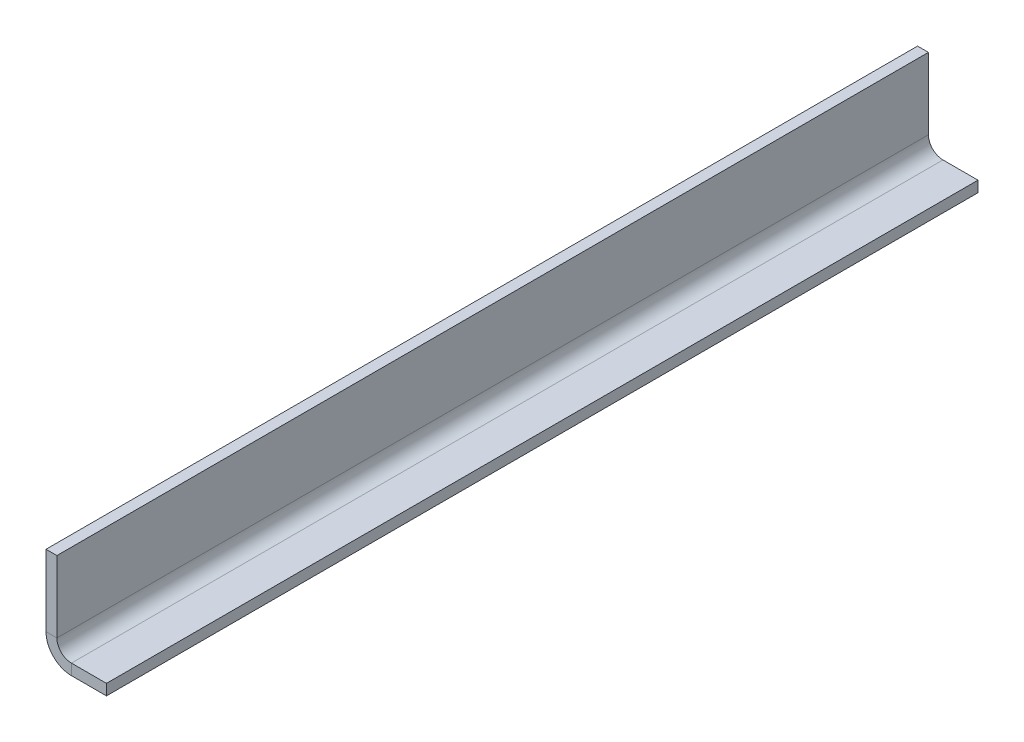
ISO-10303-21;
HEADER;
FILE_DESCRIPTION(('STEP AP214'),'2;1');
FILE_NAME('part.step','',(''),(''),'','','');
FILE_SCHEMA(('AUTOMOTIVE_DESIGN { 1 0 10303 214 1 1 1 1 }'));
ENDSEC;
DATA;
#1=APPLICATION_CONTEXT('core data for automotive mechanical design processes');
#2=APPLICATION_PROTOCOL_DEFINITION('international standard','automotive_design',2000,#1);
#3=PRODUCT_CONTEXT('',#1,'mechanical');
#4=PRODUCT('Part','Part','',(#3));
#5=PRODUCT_RELATED_PRODUCT_CATEGORY('part','',(#4));
#6=PRODUCT_DEFINITION_FORMATION('','',#4);
#7=PRODUCT_DEFINITION_CONTEXT('part definition',#1,'design');
#8=PRODUCT_DEFINITION('design','',#6,#7);
#9=PRODUCT_DEFINITION_SHAPE('','',#8);
#10=(LENGTH_UNIT() NAMED_UNIT(*) SI_UNIT(.MILLI.,.METRE.));
#11=(NAMED_UNIT(*) PLANE_ANGLE_UNIT() SI_UNIT($,.RADIAN.));
#12=(NAMED_UNIT(*) SI_UNIT($,.STERADIAN.) SOLID_ANGLE_UNIT());
#13=UNCERTAINTY_MEASURE_WITH_UNIT(LENGTH_MEASURE(1.E-05),#10,'distance_accuracy_value','');
#14=(GEOMETRIC_REPRESENTATION_CONTEXT(3) GLOBAL_UNCERTAINTY_ASSIGNED_CONTEXT((#13)) GLOBAL_UNIT_ASSIGNED_CONTEXT((#10,
#11,#12)) REPRESENTATION_CONTEXT('',''));
#15=CARTESIAN_POINT('',(0.,0.,0.));
#16=DIRECTION('',(0.,0.,1.));
#17=DIRECTION('',(1.,0.,0.));
#18=AXIS2_PLACEMENT_3D('',#15,#16,#17);
#19=CARTESIAN_POINT('',(3.175,3.175,0.));
#20=DIRECTION('',(0.,0.,1.));
#21=DIRECTION('',(0.,1.,0.));
#22=AXIS2_PLACEMENT_3D('',#19,#20,#21);
#23=PLANE('',#22);
#24=DIRECTION('',(1.,0.,0.));
#25=VECTOR('',#24,1.);
#26=CARTESIAN_POINT('',(3.175,5.175,0.));
#27=LINE('',#26,#25);
#28=CARTESIAN_POINT('',(1.675,5.175,0.));
#29=VERTEX_POINT('',#28);
#30=CARTESIAN_POINT('',(3.175,5.175,0.));
#31=VERTEX_POINT('',#30);
#32=EDGE_CURVE('E11',#29,#31,#27,.T.);
#33=ORIENTED_EDGE('',*,*,#32,.F.);
#34=DIRECTION('',(0.,-1.,0.));
#35=VECTOR('',#34,1.);
#36=CARTESIAN_POINT('',(1.675,3.175,0.));
#37=LINE('',#36,#35);
#38=CARTESIAN_POINT('',(1.675,15.,0.));
#39=VERTEX_POINT('',#38);
#40=EDGE_CURVE('E95',#29,#39,#37,.F.);
#41=ORIENTED_EDGE('',*,*,#40,.T.);
#42=DIRECTION('',(1.,0.,0.));
#43=VECTOR('',#42,1.);
#44=CARTESIAN_POINT('',(3.175,15.,0.));
#45=LINE('',#44,#43);
#46=CARTESIAN_POINT('',(3.175,15.,0.));
#47=VERTEX_POINT('',#46);
#48=EDGE_CURVE('E55',#39,#47,#45,.T.);
#49=ORIENTED_EDGE('',*,*,#48,.T.);
#50=DIRECTION('',(0.,1.,0.));
#51=VECTOR('',#50,1.);
#52=CARTESIAN_POINT('',(3.175,3.175,0.));
#53=LINE('',#52,#51);
#54=EDGE_CURVE('E98',#31,#47,#53,.T.);
#55=ORIENTED_EDGE('',*,*,#54,.F.);
#56=EDGE_LOOP('',(#33,#41,#49,#55));
#57=FACE_BOUND('',#56,.T.);
#58=ADVANCED_FACE('F45',(#57),#23,.F.);
#59=CARTESIAN_POINT('',(3.175,15.,120.));
#60=DIRECTION('',(0.,1.,0.));
#61=DIRECTION('',(0.,0.,-1.));
#62=AXIS2_PLACEMENT_3D('',#59,#60,#61);
#63=PLANE('',#62);
#64=ORIENTED_EDGE('',*,*,#48,.F.);
#65=DIRECTION('',(0.,0.,1.));
#66=VECTOR('',#65,1.);
#67=CARTESIAN_POINT('',(1.675,15.,120.));
#68=LINE('',#67,#66);
#69=CARTESIAN_POINT('',(1.675,15.,120.));
#70=VERTEX_POINT('',#69);
#71=EDGE_CURVE('E123',#70,#39,#68,.F.);
#72=ORIENTED_EDGE('',*,*,#71,.F.);
#73=DIRECTION('',(1.,0.,0.));
#74=VECTOR('',#73,1.);
#75=CARTESIAN_POINT('',(3.175,15.,120.));
#76=LINE('',#75,#74);
#77=CARTESIAN_POINT('',(3.175,15.,120.));
#78=VERTEX_POINT('',#77);
#79=EDGE_CURVE('E141',#70,#78,#76,.T.);
#80=ORIENTED_EDGE('',*,*,#79,.T.);
#81=DIRECTION('',(0.,0.,-1.));
#82=VECTOR('',#81,1.);
#83=CARTESIAN_POINT('',(3.175,15.,120.));
#84=LINE('',#83,#82);
#85=EDGE_CURVE('E152',#78,#47,#84,.T.);
#86=ORIENTED_EDGE('',*,*,#85,.T.);
#87=EDGE_LOOP('',(#64,#72,#80,#86));
#88=FACE_BOUND('',#87,.T.);
#89=ADVANCED_FACE('F158',(#88),#63,.T.);
#90=CARTESIAN_POINT('',(3.175,3.175,120.));
#91=DIRECTION('',(0.,0.,1.));
#92=DIRECTION('',(0.,1.,0.));
#93=AXIS2_PLACEMENT_3D('',#90,#91,#92);
#94=PLANE('',#93);
#95=ORIENTED_EDGE('',*,*,#79,.F.);
#96=DIRECTION('',(0.,-1.,0.));
#97=VECTOR('',#96,1.);
#98=CARTESIAN_POINT('',(1.675,3.175,120.));
#99=LINE('',#98,#97);
#100=CARTESIAN_POINT('',(1.675,5.175,120.));
#101=VERTEX_POINT('',#100);
#102=EDGE_CURVE('E183',#101,#70,#99,.F.);
#103=ORIENTED_EDGE('',*,*,#102,.F.);
#104=DIRECTION('',(1.,0.,0.));
#105=VECTOR('',#104,1.);
#106=CARTESIAN_POINT('',(3.175,5.175,120.));
#107=LINE('',#106,#105);
#108=CARTESIAN_POINT('',(3.175,5.175,120.));
#109=VERTEX_POINT('',#108);
#110=EDGE_CURVE('E138',#101,#109,#107,.T.);
#111=ORIENTED_EDGE('',*,*,#110,.T.);
#112=DIRECTION('',(0.,1.,0.));
#113=VECTOR('',#112,1.);
#114=CARTESIAN_POINT('',(3.175,3.175,120.));
#115=LINE('',#114,#113);
#116=EDGE_CURVE('E159',#109,#78,#115,.T.);
#117=ORIENTED_EDGE('',*,*,#116,.T.);
#118=EDGE_LOOP('',(#95,#103,#111,#117));
#119=FACE_BOUND('',#118,.T.);
#120=ADVANCED_FACE('F189',(#119),#94,.T.);
#121=CARTESIAN_POINT('',(5.175,5.175,120.));
#122=DIRECTION('',(0.,0.,1.));
#123=DIRECTION('',(1.,0.,0.));
#124=AXIS2_PLACEMENT_3D('',#121,#122,#123);
#125=PLANE('',#124);
#126=ORIENTED_EDGE('',*,*,#110,.F.);
#127=CARTESIAN_POINT('',(5.175,5.175,120.));
#128=DIRECTION('',(0.,0.,1.));
#129=DIRECTION('',(1.,0.,0.));
#130=AXIS2_PLACEMENT_3D('',#127,#128,#129);
#131=CIRCLE('',#130,3.5);
#132=CARTESIAN_POINT('',(5.17500000000001,1.675,120.));
#133=VERTEX_POINT('',#132);
#134=EDGE_CURVE('E113',#101,#133,#131,.T.);
#135=ORIENTED_EDGE('',*,*,#134,.T.);
#136=DIRECTION('',(0.,1.,0.));
#137=VECTOR('',#136,1.);
#138=CARTESIAN_POINT('',(5.175,3.175,120.));
#139=LINE('',#138,#137);
#140=CARTESIAN_POINT('',(5.175,3.175,120.));
#141=VERTEX_POINT('',#140);
#142=EDGE_CURVE('E63',#133,#141,#139,.T.);
#143=ORIENTED_EDGE('',*,*,#142,.T.);
#144=CARTESIAN_POINT('',(5.175,5.175,120.));
#145=DIRECTION('',(0.,0.,-1.));
#146=DIRECTION('',(-1.,0.,0.));
#147=AXIS2_PLACEMENT_3D('',#144,#145,#146);
#148=CIRCLE('',#147,2.);
#149=EDGE_CURVE('E156',#109,#141,#148,.F.);
#150=ORIENTED_EDGE('',*,*,#149,.F.);
#151=EDGE_LOOP('',(#126,#135,#143,#150));
#152=FACE_BOUND('',#151,.T.);
#153=ADVANCED_FACE('F192',(#152),#125,.T.);
#154=CARTESIAN_POINT('',(10.,3.175,120.));
#155=DIRECTION('',(0.,0.,1.));
#156=DIRECTION('',(-1.,0.,0.));
#157=AXIS2_PLACEMENT_3D('',#154,#155,#156);
#158=PLANE('',#157);
#159=ORIENTED_EDGE('',*,*,#142,.F.);
#160=DIRECTION('',(1.,0.,0.));
#161=VECTOR('',#160,1.);
#162=CARTESIAN_POINT('',(10.,1.675,120.));
#163=LINE('',#162,#161);
#164=CARTESIAN_POINT('',(10.,1.675,120.));
#165=VERTEX_POINT('',#164);
#166=EDGE_CURVE('E182',#165,#133,#163,.F.);
#167=ORIENTED_EDGE('',*,*,#166,.F.);
#168=DIRECTION('',(0.,1.,0.));
#169=VECTOR('',#168,1.);
#170=CARTESIAN_POINT('',(10.,3.175,120.));
#171=LINE('',#170,#169);
#172=CARTESIAN_POINT('',(10.,3.175,120.));
#173=VERTEX_POINT('',#172);
#174=EDGE_CURVE('E134',#165,#173,#171,.T.);
#175=ORIENTED_EDGE('',*,*,#174,.T.);
#176=DIRECTION('',(-1.,0.,0.));
#177=VECTOR('',#176,1.);
#178=CARTESIAN_POINT('',(10.,3.175,120.));
#179=LINE('',#178,#177);
#180=EDGE_CURVE('E166',#173,#141,#179,.T.);
#181=ORIENTED_EDGE('',*,*,#180,.T.);
#182=EDGE_LOOP('',(#159,#167,#175,#181));
#183=FACE_BOUND('',#182,.T.);
#184=ADVANCED_FACE('F203',(#183),#158,.T.);
#185=CARTESIAN_POINT('',(10.,3.175,120.));
#186=DIRECTION('',(-1.,0.,0.));
#187=DIRECTION('',(0.,0.,-1.));
#188=AXIS2_PLACEMENT_3D('',#185,#186,#187);
#189=PLANE('',#188);
#190=ORIENTED_EDGE('',*,*,#174,.F.);
#191=DIRECTION('',(0.,0.,1.));
#192=VECTOR('',#191,1.);
#193=CARTESIAN_POINT('',(10.,1.675,120.));
#194=LINE('',#193,#192);
#195=CARTESIAN_POINT('',(10.,1.675,0.));
#196=VERTEX_POINT('',#195);
#197=EDGE_CURVE('E118',#165,#196,#194,.F.);
#198=ORIENTED_EDGE('',*,*,#197,.T.);
#199=DIRECTION('',(0.,1.,0.));
#200=VECTOR('',#199,1.);
#201=CARTESIAN_POINT('',(10.,3.175,0.));
#202=LINE('',#201,#200);
#203=CARTESIAN_POINT('',(10.,3.175,0.));
#204=VERTEX_POINT('',#203);
#205=EDGE_CURVE('E131',#196,#204,#202,.T.);
#206=ORIENTED_EDGE('',*,*,#205,.T.);
#207=DIRECTION('',(0.,0.,-1.));
#208=VECTOR('',#207,1.);
#209=CARTESIAN_POINT('',(10.,3.175,120.));
#210=LINE('',#209,#208);
#211=EDGE_CURVE('E169',#173,#204,#210,.T.);
#212=ORIENTED_EDGE('',*,*,#211,.F.);
#213=EDGE_LOOP('',(#190,#198,#206,#212));
#214=FACE_BOUND('',#213,.T.);
#215=ADVANCED_FACE('F209',(#214),#189,.F.);
#216=CARTESIAN_POINT('',(10.,3.175,0.));
#217=DIRECTION('',(0.,0.,1.));
#218=DIRECTION('',(-1.,0.,0.));
#219=AXIS2_PLACEMENT_3D('',#216,#217,#218);
#220=PLANE('',#219);
#221=ORIENTED_EDGE('',*,*,#205,.F.);
#222=DIRECTION('',(1.,0.,0.));
#223=VECTOR('',#222,1.);
#224=CARTESIAN_POINT('',(10.,1.675,0.));
#225=LINE('',#224,#223);
#226=CARTESIAN_POINT('',(5.175,1.675,0.));
#227=VERTEX_POINT('',#226);
#228=EDGE_CURVE('E180',#196,#227,#225,.F.);
#229=ORIENTED_EDGE('',*,*,#228,.T.);
#230=DIRECTION('',(0.,1.,0.));
#231=VECTOR('',#230,1.);
#232=CARTESIAN_POINT('',(5.175,3.175,0.));
#233=LINE('',#232,#231);
#234=CARTESIAN_POINT('',(5.175,3.175,0.));
#235=VERTEX_POINT('',#234);
#236=EDGE_CURVE('E49',#227,#235,#233,.T.);
#237=ORIENTED_EDGE('',*,*,#236,.T.);
#238=DIRECTION('',(-1.,0.,0.));
#239=VECTOR('',#238,1.);
#240=CARTESIAN_POINT('',(10.,3.175,0.));
#241=LINE('',#240,#239);
#242=EDGE_CURVE('E161',#204,#235,#241,.T.);
#243=ORIENTED_EDGE('',*,*,#242,.F.);
#244=EDGE_LOOP('',(#221,#229,#237,#243));
#245=FACE_BOUND('',#244,.T.);
#246=ADVANCED_FACE('F213',(#245),#220,.F.);
#247=CARTESIAN_POINT('',(5.175,5.175,0.));
#248=DIRECTION('',(0.,0.,-1.));
#249=DIRECTION('',(-1.,0.,0.));
#250=AXIS2_PLACEMENT_3D('',#247,#248,#249);
#251=PLANE('',#250);
#252=CARTESIAN_POINT('',(5.175,5.175,0.));
#253=DIRECTION('',(0.,0.,1.));
#254=DIRECTION('',(1.,0.,0.));
#255=AXIS2_PLACEMENT_3D('',#252,#253,#254);
#256=CIRCLE('',#255,3.5);
#257=EDGE_CURVE('E111',#227,#29,#256,.F.);
#258=ORIENTED_EDGE('',*,*,#257,.T.);
#259=ORIENTED_EDGE('',*,*,#32,.T.);
#260=CARTESIAN_POINT('',(5.175,5.175,0.));
#261=DIRECTION('',(0.,0.,1.));
#262=DIRECTION('',(1.,0.,0.));
#263=AXIS2_PLACEMENT_3D('',#260,#261,#262);
#264=CIRCLE('',#263,2.);
#265=EDGE_CURVE('E176',#235,#31,#264,.F.);
#266=ORIENTED_EDGE('',*,*,#265,.F.);
#267=ORIENTED_EDGE('',*,*,#236,.F.);
#268=EDGE_LOOP('',(#258,#259,#266,#267));
#269=FACE_BOUND('',#268,.T.);
#270=ADVANCED_FACE('F47',(#269),#251,.T.);
#271=CARTESIAN_POINT('',(10.,3.175,120.));
#272=DIRECTION('',(0.,-1.,0.));
#273=DIRECTION('',(1.,0.,0.));
#274=AXIS2_PLACEMENT_3D('',#271,#272,#273);
#275=PLANE('',#274);
#276=ORIENTED_EDGE('',*,*,#242,.T.);
#277=DIRECTION('',(0.,0.,-1.));
#278=VECTOR('',#277,1.);
#279=CARTESIAN_POINT('',(5.175,3.175,120.));
#280=LINE('',#279,#278);
#281=EDGE_CURVE('E173',#235,#141,#280,.F.);
#282=ORIENTED_EDGE('',*,*,#281,.T.);
#283=ORIENTED_EDGE('',*,*,#180,.F.);
#284=ORIENTED_EDGE('',*,*,#211,.T.);
#285=EDGE_LOOP('',(#276,#282,#283,#284));
#286=FACE_BOUND('',#285,.T.);
#287=ADVANCED_FACE('F208',(#286),#275,.F.);
#288=CARTESIAN_POINT('',(3.175,3.175,120.));
#289=DIRECTION('',(-1.,0.,0.));
#290=DIRECTION('',(0.,-1.,0.));
#291=AXIS2_PLACEMENT_3D('',#288,#289,#290);
#292=PLANE('',#291);
#293=ORIENTED_EDGE('',*,*,#116,.F.);
#294=DIRECTION('',(0.,0.,-1.));
#295=VECTOR('',#294,1.);
#296=CARTESIAN_POINT('',(3.175,5.175,0.));
#297=LINE('',#296,#295);
#298=EDGE_CURVE('E155',#109,#31,#297,.T.);
#299=ORIENTED_EDGE('',*,*,#298,.T.);
#300=ORIENTED_EDGE('',*,*,#54,.T.);
#301=ORIENTED_EDGE('',*,*,#85,.F.);
#302=EDGE_LOOP('',(#293,#299,#300,#301));
#303=FACE_BOUND('',#302,.T.);
#304=ADVANCED_FACE('F151',(#303),#292,.F.);
#305=CARTESIAN_POINT('',(5.175,5.175,120.));
#306=DIRECTION('',(0.,0.,1.));
#307=DIRECTION('',(1.,0.,0.));
#308=AXIS2_PLACEMENT_3D('',#305,#306,#307);
#309=CYLINDRICAL_SURFACE('',#308,2.);
#310=ORIENTED_EDGE('',*,*,#149,.T.);
#311=ORIENTED_EDGE('',*,*,#281,.F.);
#312=ORIENTED_EDGE('',*,*,#265,.T.);
#313=ORIENTED_EDGE('',*,*,#298,.F.);
#314=EDGE_LOOP('',(#310,#311,#312,#313));
#315=FACE_BOUND('',#314,.T.);
#316=ADVANCED_FACE('F195',(#315),#309,.F.);
#317=CARTESIAN_POINT('',(10.,1.675,120.));
#318=DIRECTION('',(0.,-1.,0.));
#319=DIRECTION('',(1.,0.,0.));
#320=AXIS2_PLACEMENT_3D('',#317,#318,#319);
#321=PLANE('',#320);
#322=ORIENTED_EDGE('',*,*,#228,.F.);
#323=ORIENTED_EDGE('',*,*,#197,.F.);
#324=ORIENTED_EDGE('',*,*,#166,.T.);
#325=DIRECTION('',(0.,0.,1.));
#326=VECTOR('',#325,1.);
#327=CARTESIAN_POINT('',(5.175,1.675,120.));
#328=LINE('',#327,#326);
#329=EDGE_CURVE('E117',#227,#133,#328,.T.);
#330=ORIENTED_EDGE('',*,*,#329,.F.);
#331=EDGE_LOOP('',(#322,#323,#324,#330));
#332=FACE_BOUND('',#331,.T.);
#333=ADVANCED_FACE('F215',(#332),#321,.T.);
#334=CARTESIAN_POINT('',(1.675,3.175,120.));
#335=DIRECTION('',(-1.,0.,0.));
#336=DIRECTION('',(0.,-1.,0.));
#337=AXIS2_PLACEMENT_3D('',#334,#335,#336);
#338=PLANE('',#337);
#339=ORIENTED_EDGE('',*,*,#102,.T.);
#340=ORIENTED_EDGE('',*,*,#71,.T.);
#341=ORIENTED_EDGE('',*,*,#40,.F.);
#342=DIRECTION('',(0.,0.,1.));
#343=VECTOR('',#342,1.);
#344=CARTESIAN_POINT('',(1.675,5.175,120.));
#345=LINE('',#344,#343);
#346=EDGE_CURVE('E108',#101,#29,#345,.F.);
#347=ORIENTED_EDGE('',*,*,#346,.F.);
#348=EDGE_LOOP('',(#339,#340,#341,#347));
#349=FACE_BOUND('',#348,.T.);
#350=ADVANCED_FACE('F121',(#349),#338,.T.);
#351=CARTESIAN_POINT('',(5.175,5.175,120.));
#352=DIRECTION('',(0.,0.,1.));
#353=DIRECTION('',(1.,0.,0.));
#354=AXIS2_PLACEMENT_3D('',#351,#352,#353);
#355=CYLINDRICAL_SURFACE('',#354,3.5);
#356=ORIENTED_EDGE('',*,*,#134,.F.);
#357=ORIENTED_EDGE('',*,*,#346,.T.);
#358=ORIENTED_EDGE('',*,*,#257,.F.);
#359=ORIENTED_EDGE('',*,*,#329,.T.);
#360=EDGE_LOOP('',(#356,#357,#358,#359));
#361=FACE_BOUND('',#360,.T.);
#362=ADVANCED_FACE('F109',(#361),#355,.T.);
#363=CLOSED_SHELL('',(#58,#89,#120,#153,#184,#215,#246,#270,#287,#304,#316,#333,#350,#362));
#364=MANIFOLD_SOLID_BREP('B2',#363);
#365=ADVANCED_BREP_SHAPE_REPRESENTATION('',(#18,#364),#14);
#366=SHAPE_DEFINITION_REPRESENTATION(#9,#365);
ENDSEC;
END-ISO-10303-21;
